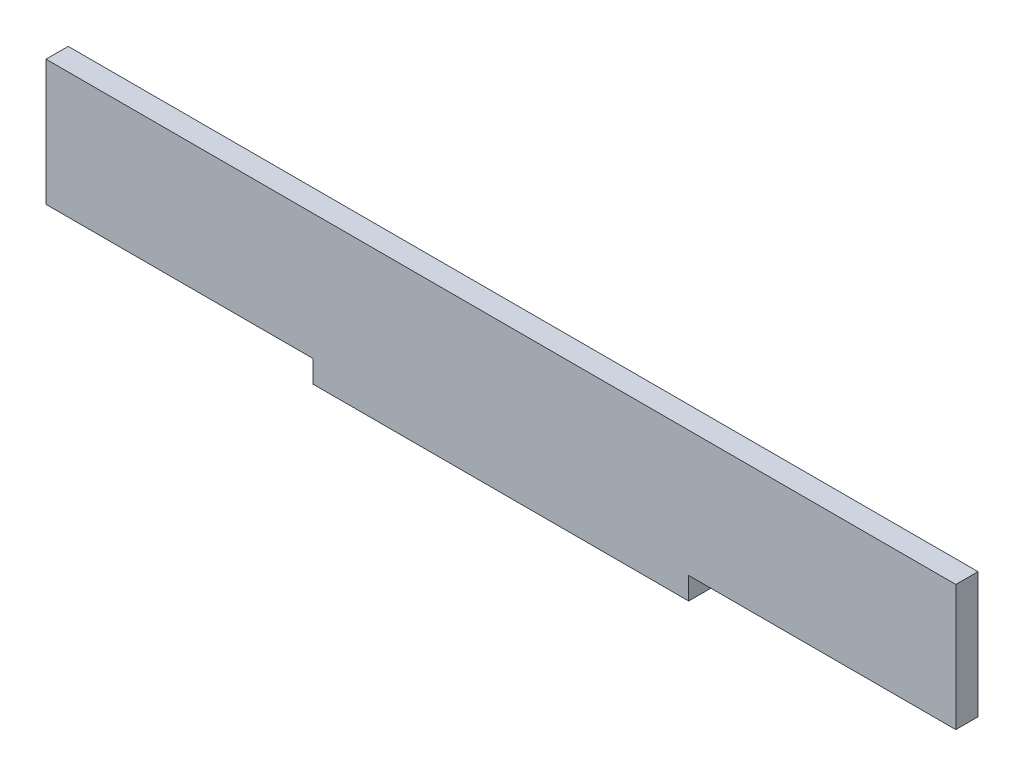
ISO-10303-21;
HEADER;
FILE_DESCRIPTION(('STEP AP214'),'2;1');
FILE_NAME('part.step','',(''),(''),'','','');
FILE_SCHEMA(('AUTOMOTIVE_DESIGN { 1 0 10303 214 1 1 1 1 }'));
ENDSEC;
DATA;
#1=APPLICATION_CONTEXT('core data for automotive mechanical design processes');
#2=APPLICATION_PROTOCOL_DEFINITION('international standard','automotive_design',2000,#1);
#3=PRODUCT_CONTEXT('',#1,'mechanical');
#4=PRODUCT('Part','Part','',(#3));
#5=PRODUCT_RELATED_PRODUCT_CATEGORY('part','',(#4));
#6=PRODUCT_DEFINITION_FORMATION('','',#4);
#7=PRODUCT_DEFINITION_CONTEXT('part definition',#1,'design');
#8=PRODUCT_DEFINITION('design','',#6,#7);
#9=PRODUCT_DEFINITION_SHAPE('','',#8);
#10=(LENGTH_UNIT() NAMED_UNIT(*) SI_UNIT(.MILLI.,.METRE.));
#11=(NAMED_UNIT(*) PLANE_ANGLE_UNIT() SI_UNIT($,.RADIAN.));
#12=(NAMED_UNIT(*) SI_UNIT($,.STERADIAN.) SOLID_ANGLE_UNIT());
#13=UNCERTAINTY_MEASURE_WITH_UNIT(LENGTH_MEASURE(1.E-05),#10,'distance_accuracy_value','');
#14=(GEOMETRIC_REPRESENTATION_CONTEXT(3) GLOBAL_UNCERTAINTY_ASSIGNED_CONTEXT((#13)) GLOBAL_UNIT_ASSIGNED_CONTEXT((#10,
#11,#12)) REPRESENTATION_CONTEXT('',''));
#15=CARTESIAN_POINT('',(0.,0.,0.));
#16=DIRECTION('',(0.,0.,1.));
#17=DIRECTION('',(1.,0.,0.));
#18=AXIS2_PLACEMENT_3D('',#15,#16,#17);
#19=CARTESIAN_POINT('',(61.5,8.49999999999999,3.));
#20=DIRECTION('',(-1.,0.,0.));
#21=DIRECTION('',(0.,0.,1.));
#22=AXIS2_PLACEMENT_3D('',#19,#20,#21);
#23=PLANE('',#22);
#24=DIRECTION('',(0.,1.,0.));
#25=VECTOR('',#24,1.);
#26=CARTESIAN_POINT('',(61.5,8.49999999999999,0.));
#27=LINE('',#26,#25);
#28=CARTESIAN_POINT('',(61.5,-8.50000000000001,0.));
#29=VERTEX_POINT('',#28);
#30=CARTESIAN_POINT('',(61.5,8.49999999999999,0.));
#31=VERTEX_POINT('',#30);
#32=EDGE_CURVE('E129',#29,#31,#27,.T.);
#33=ORIENTED_EDGE('',*,*,#32,.T.);
#34=DIRECTION('',(0.,0.,-1.));
#35=VECTOR('',#34,1.);
#36=CARTESIAN_POINT('',(61.5,8.49999999999999,3.));
#37=LINE('',#36,#35);
#38=CARTESIAN_POINT('',(61.5,8.49999999999999,3.));
#39=VERTEX_POINT('',#38);
#40=EDGE_CURVE('E11',#39,#31,#37,.T.);
#41=ORIENTED_EDGE('',*,*,#40,.F.);
#42=DIRECTION('',(0.,1.,0.));
#43=VECTOR('',#42,1.);
#44=CARTESIAN_POINT('',(61.5,8.49999999999999,3.));
#45=LINE('',#44,#43);
#46=CARTESIAN_POINT('',(61.5,-8.50000000000001,3.));
#47=VERTEX_POINT('',#46);
#48=EDGE_CURVE('E143',#47,#39,#45,.T.);
#49=ORIENTED_EDGE('',*,*,#48,.F.);
#50=DIRECTION('',(0.,0.,-1.));
#51=VECTOR('',#50,1.);
#52=CARTESIAN_POINT('',(61.5,-8.50000000000001,3.));
#53=LINE('',#52,#51);
#54=EDGE_CURVE('E125',#47,#29,#53,.T.);
#55=ORIENTED_EDGE('',*,*,#54,.T.);
#56=EDGE_LOOP('',(#33,#41,#49,#55));
#57=FACE_BOUND('',#56,.T.);
#58=ADVANCED_FACE('F33',(#57),#23,.F.);
#59=CARTESIAN_POINT('',(-61.5,8.49999999999999,3.));
#60=DIRECTION('',(0.,-1.,0.));
#61=DIRECTION('',(0.,0.,-1.));
#62=AXIS2_PLACEMENT_3D('',#59,#60,#61);
#63=PLANE('',#62);
#64=DIRECTION('',(-1.,0.,0.));
#65=VECTOR('',#64,1.);
#66=CARTESIAN_POINT('',(-61.5,8.49999999999999,0.));
#67=LINE('',#66,#65);
#68=CARTESIAN_POINT('',(-61.5,8.49999999999999,0.));
#69=VERTEX_POINT('',#68);
#70=EDGE_CURVE('E132',#31,#69,#67,.T.);
#71=ORIENTED_EDGE('',*,*,#70,.T.);
#72=DIRECTION('',(0.,0.,-1.));
#73=VECTOR('',#72,1.);
#74=CARTESIAN_POINT('',(-61.5,8.49999999999999,3.));
#75=LINE('',#74,#73);
#76=CARTESIAN_POINT('',(-61.5,8.49999999999999,3.));
#77=VERTEX_POINT('',#76);
#78=EDGE_CURVE('E41',#77,#69,#75,.T.);
#79=ORIENTED_EDGE('',*,*,#78,.F.);
#80=DIRECTION('',(-1.,0.,0.));
#81=VECTOR('',#80,1.);
#82=CARTESIAN_POINT('',(-61.5,8.49999999999999,3.));
#83=LINE('',#82,#81);
#84=EDGE_CURVE('E92',#39,#77,#83,.T.);
#85=ORIENTED_EDGE('',*,*,#84,.F.);
#86=ORIENTED_EDGE('',*,*,#40,.T.);
#87=EDGE_LOOP('',(#71,#79,#85,#86));
#88=FACE_BOUND('',#87,.T.);
#89=ADVANCED_FACE('F178',(#88),#63,.F.);
#90=CARTESIAN_POINT('',(-61.5,8.49999999999999,3.));
#91=DIRECTION('',(1.,0.,0.));
#92=DIRECTION('',(0.,1.,0.));
#93=AXIS2_PLACEMENT_3D('',#90,#91,#92);
#94=PLANE('',#93);
#95=DIRECTION('',(0.,-1.,0.));
#96=VECTOR('',#95,1.);
#97=CARTESIAN_POINT('',(-61.5,8.49999999999999,0.));
#98=LINE('',#97,#96);
#99=CARTESIAN_POINT('',(-61.5,-8.50000000000001,0.));
#100=VERTEX_POINT('',#99);
#101=EDGE_CURVE('E134',#69,#100,#98,.T.);
#102=ORIENTED_EDGE('',*,*,#101,.T.);
#103=DIRECTION('',(0.,0.,-1.));
#104=VECTOR('',#103,1.);
#105=CARTESIAN_POINT('',(-61.5,-8.50000000000001,3.));
#106=LINE('',#105,#104);
#107=CARTESIAN_POINT('',(-61.5,-8.50000000000001,3.));
#108=VERTEX_POINT('',#107);
#109=EDGE_CURVE('E150',#108,#100,#106,.T.);
#110=ORIENTED_EDGE('',*,*,#109,.F.);
#111=DIRECTION('',(0.,-1.,0.));
#112=VECTOR('',#111,1.);
#113=CARTESIAN_POINT('',(-61.5,8.49999999999999,3.));
#114=LINE('',#113,#112);
#115=EDGE_CURVE('E158',#77,#108,#114,.T.);
#116=ORIENTED_EDGE('',*,*,#115,.F.);
#117=ORIENTED_EDGE('',*,*,#78,.T.);
#118=EDGE_LOOP('',(#102,#110,#116,#117));
#119=FACE_BOUND('',#118,.T.);
#120=ADVANCED_FACE('F156',(#119),#94,.F.);
#121=CARTESIAN_POINT('',(-61.5,-8.50000000000001,3.));
#122=DIRECTION('',(0.,1.,0.));
#123=DIRECTION('',(-1.,0.,0.));
#124=AXIS2_PLACEMENT_3D('',#121,#122,#123);
#125=PLANE('',#124);
#126=DIRECTION('',(1.,0.,0.));
#127=VECTOR('',#126,1.);
#128=CARTESIAN_POINT('',(-61.5,-8.50000000000001,0.));
#129=LINE('',#128,#127);
#130=CARTESIAN_POINT('',(-25.386829775487,-8.5,0.));
#131=VERTEX_POINT('',#130);
#132=EDGE_CURVE('E136',#100,#131,#129,.T.);
#133=ORIENTED_EDGE('',*,*,#132,.T.);
#134=DIRECTION('',(0.,0.,-1.));
#135=VECTOR('',#134,1.);
#136=CARTESIAN_POINT('',(-25.386829775487,-8.5,3.));
#137=LINE('',#136,#135);
#138=CARTESIAN_POINT('',(-25.386829775487,-8.5,3.));
#139=VERTEX_POINT('',#138);
#140=EDGE_CURVE('E147',#139,#131,#137,.T.);
#141=ORIENTED_EDGE('',*,*,#140,.F.);
#142=DIRECTION('',(1.,0.,0.));
#143=VECTOR('',#142,1.);
#144=CARTESIAN_POINT('',(-61.5,-8.50000000000001,3.));
#145=LINE('',#144,#143);
#146=EDGE_CURVE('E170',#108,#139,#145,.T.);
#147=ORIENTED_EDGE('',*,*,#146,.F.);
#148=ORIENTED_EDGE('',*,*,#109,.T.);
#149=EDGE_LOOP('',(#133,#141,#147,#148));
#150=FACE_BOUND('',#149,.T.);
#151=ADVANCED_FACE('F166',(#150),#125,.F.);
#152=CARTESIAN_POINT('',(-25.386829775487,-11.5,3.));
#153=DIRECTION('',(1.,0.,0.));
#154=DIRECTION('',(0.,0.,-1.));
#155=AXIS2_PLACEMENT_3D('',#152,#153,#154);
#156=PLANE('',#155);
#157=DIRECTION('',(0.,-1.,0.));
#158=VECTOR('',#157,1.);
#159=CARTESIAN_POINT('',(-25.386829775487,-11.5,0.));
#160=LINE('',#159,#158);
#161=CARTESIAN_POINT('',(-25.386829775487,-11.5,0.));
#162=VERTEX_POINT('',#161);
#163=EDGE_CURVE('E138',#131,#162,#160,.T.);
#164=ORIENTED_EDGE('',*,*,#163,.T.);
#165=DIRECTION('',(0.,0.,-1.));
#166=VECTOR('',#165,1.);
#167=CARTESIAN_POINT('',(-25.386829775487,-11.5,3.));
#168=LINE('',#167,#166);
#169=CARTESIAN_POINT('',(-25.386829775487,-11.5,3.));
#170=VERTEX_POINT('',#169);
#171=EDGE_CURVE('E120',#170,#162,#168,.T.);
#172=ORIENTED_EDGE('',*,*,#171,.F.);
#173=DIRECTION('',(0.,-1.,0.));
#174=VECTOR('',#173,1.);
#175=CARTESIAN_POINT('',(-25.386829775487,-11.5,3.));
#176=LINE('',#175,#174);
#177=EDGE_CURVE('E111',#139,#170,#176,.T.);
#178=ORIENTED_EDGE('',*,*,#177,.F.);
#179=ORIENTED_EDGE('',*,*,#140,.T.);
#180=EDGE_LOOP('',(#164,#172,#178,#179));
#181=FACE_BOUND('',#180,.T.);
#182=ADVANCED_FACE('F169',(#181),#156,.F.);
#183=CARTESIAN_POINT('',(-25.386829775487,-11.5,3.));
#184=DIRECTION('',(0.,1.,0.));
#185=DIRECTION('',(-1.,0.,0.));
#186=AXIS2_PLACEMENT_3D('',#183,#184,#185);
#187=PLANE('',#186);
#188=DIRECTION('',(1.,0.,0.));
#189=VECTOR('',#188,1.);
#190=CARTESIAN_POINT('',(-25.386829775487,-11.5,0.));
#191=LINE('',#190,#189);
#192=CARTESIAN_POINT('',(25.386829775487,-11.5,0.));
#193=VERTEX_POINT('',#192);
#194=EDGE_CURVE('E119',#162,#193,#191,.T.);
#195=ORIENTED_EDGE('',*,*,#194,.T.);
#196=DIRECTION('',(0.,0.,-1.));
#197=VECTOR('',#196,1.);
#198=CARTESIAN_POINT('',(25.386829775487,-11.5,3.));
#199=LINE('',#198,#197);
#200=CARTESIAN_POINT('',(25.386829775487,-11.5,3.));
#201=VERTEX_POINT('',#200);
#202=EDGE_CURVE('E116',#201,#193,#199,.T.);
#203=ORIENTED_EDGE('',*,*,#202,.F.);
#204=DIRECTION('',(1.,0.,0.));
#205=VECTOR('',#204,1.);
#206=CARTESIAN_POINT('',(-25.386829775487,-11.5,3.));
#207=LINE('',#206,#205);
#208=EDGE_CURVE('E105',#170,#201,#207,.T.);
#209=ORIENTED_EDGE('',*,*,#208,.F.);
#210=ORIENTED_EDGE('',*,*,#171,.T.);
#211=EDGE_LOOP('',(#195,#203,#209,#210));
#212=FACE_BOUND('',#211,.T.);
#213=ADVANCED_FACE('F117',(#212),#187,.F.);
#214=CARTESIAN_POINT('',(25.386829775487,-11.5,3.));
#215=DIRECTION('',(-1.,0.,0.));
#216=DIRECTION('',(0.,0.,1.));
#217=AXIS2_PLACEMENT_3D('',#214,#215,#216);
#218=PLANE('',#217);
#219=DIRECTION('',(0.,1.,0.));
#220=VECTOR('',#219,1.);
#221=CARTESIAN_POINT('',(25.386829775487,-11.5,0.));
#222=LINE('',#221,#220);
#223=CARTESIAN_POINT('',(25.386829775487,-8.5,0.));
#224=VERTEX_POINT('',#223);
#225=EDGE_CURVE('E78',#193,#224,#222,.T.);
#226=ORIENTED_EDGE('',*,*,#225,.T.);
#227=DIRECTION('',(0.,0.,-1.));
#228=VECTOR('',#227,1.);
#229=CARTESIAN_POINT('',(25.386829775487,-8.5,3.));
#230=LINE('',#229,#228);
#231=CARTESIAN_POINT('',(25.386829775487,-8.5,3.));
#232=VERTEX_POINT('',#231);
#233=EDGE_CURVE('E121',#232,#224,#230,.T.);
#234=ORIENTED_EDGE('',*,*,#233,.F.);
#235=DIRECTION('',(0.,1.,0.));
#236=VECTOR('',#235,1.);
#237=CARTESIAN_POINT('',(25.386829775487,-11.5,3.));
#238=LINE('',#237,#236);
#239=EDGE_CURVE('E109',#201,#232,#238,.T.);
#240=ORIENTED_EDGE('',*,*,#239,.F.);
#241=ORIENTED_EDGE('',*,*,#202,.T.);
#242=EDGE_LOOP('',(#226,#234,#240,#241));
#243=FACE_BOUND('',#242,.T.);
#244=ADVANCED_FACE('F123',(#243),#218,.F.);
#245=CARTESIAN_POINT('',(25.386829775487,-8.5,3.));
#246=DIRECTION('',(0.,1.,0.));
#247=DIRECTION('',(-1.,0.,0.));
#248=AXIS2_PLACEMENT_3D('',#245,#246,#247);
#249=PLANE('',#248);
#250=DIRECTION('',(1.,0.,0.));
#251=VECTOR('',#250,1.);
#252=CARTESIAN_POINT('',(25.386829775487,-8.5,0.));
#253=LINE('',#252,#251);
#254=EDGE_CURVE('E84',#224,#29,#253,.T.);
#255=ORIENTED_EDGE('',*,*,#254,.T.);
#256=ORIENTED_EDGE('',*,*,#54,.F.);
#257=DIRECTION('',(1.,0.,0.));
#258=VECTOR('',#257,1.);
#259=CARTESIAN_POINT('',(25.386829775487,-8.5,3.));
#260=LINE('',#259,#258);
#261=EDGE_CURVE('E49',#232,#47,#260,.T.);
#262=ORIENTED_EDGE('',*,*,#261,.F.);
#263=ORIENTED_EDGE('',*,*,#233,.T.);
#264=EDGE_LOOP('',(#255,#256,#262,#263));
#265=FACE_BOUND('',#264,.T.);
#266=ADVANCED_FACE('F194',(#265),#249,.F.);
#267=CARTESIAN_POINT('',(0.,0.,3.));
#268=DIRECTION('',(0.,0.,1.));
#269=DIRECTION('',(1.,0.,0.));
#270=AXIS2_PLACEMENT_3D('',#267,#268,#269);
#271=PLANE('',#270);
#272=ORIENTED_EDGE('',*,*,#48,.T.);
#273=ORIENTED_EDGE('',*,*,#84,.T.);
#274=ORIENTED_EDGE('',*,*,#115,.T.);
#275=ORIENTED_EDGE('',*,*,#146,.T.);
#276=ORIENTED_EDGE('',*,*,#177,.T.);
#277=ORIENTED_EDGE('',*,*,#208,.T.);
#278=ORIENTED_EDGE('',*,*,#239,.T.);
#279=ORIENTED_EDGE('',*,*,#261,.T.);
#280=EDGE_LOOP('',(#272,#273,#274,#275,#276,#277,#278,#279));
#281=FACE_BOUND('',#280,.T.);
#282=ADVANCED_FACE('F107',(#281),#271,.T.);
#283=CARTESIAN_POINT('',(0.,0.,0.));
#284=DIRECTION('',(0.,0.,1.));
#285=DIRECTION('',(1.,0.,0.));
#286=AXIS2_PLACEMENT_3D('',#283,#284,#285);
#287=PLANE('',#286);
#288=ORIENTED_EDGE('',*,*,#32,.F.);
#289=ORIENTED_EDGE('',*,*,#254,.F.);
#290=ORIENTED_EDGE('',*,*,#225,.F.);
#291=ORIENTED_EDGE('',*,*,#194,.F.);
#292=ORIENTED_EDGE('',*,*,#163,.F.);
#293=ORIENTED_EDGE('',*,*,#132,.F.);
#294=ORIENTED_EDGE('',*,*,#101,.F.);
#295=ORIENTED_EDGE('',*,*,#70,.F.);
#296=EDGE_LOOP('',(#288,#289,#290,#291,#292,#293,#294,#295));
#297=FACE_BOUND('',#296,.T.);
#298=ADVANCED_FACE('F162',(#297),#287,.F.);
#299=CLOSED_SHELL('',(#58,#89,#120,#151,#182,#213,#244,#266,#282,#298));
#300=MANIFOLD_SOLID_BREP('B2',#299);
#301=ADVANCED_BREP_SHAPE_REPRESENTATION('',(#18,#300),#14);
#302=SHAPE_DEFINITION_REPRESENTATION(#9,#301);
ENDSEC;
END-ISO-10303-21;
